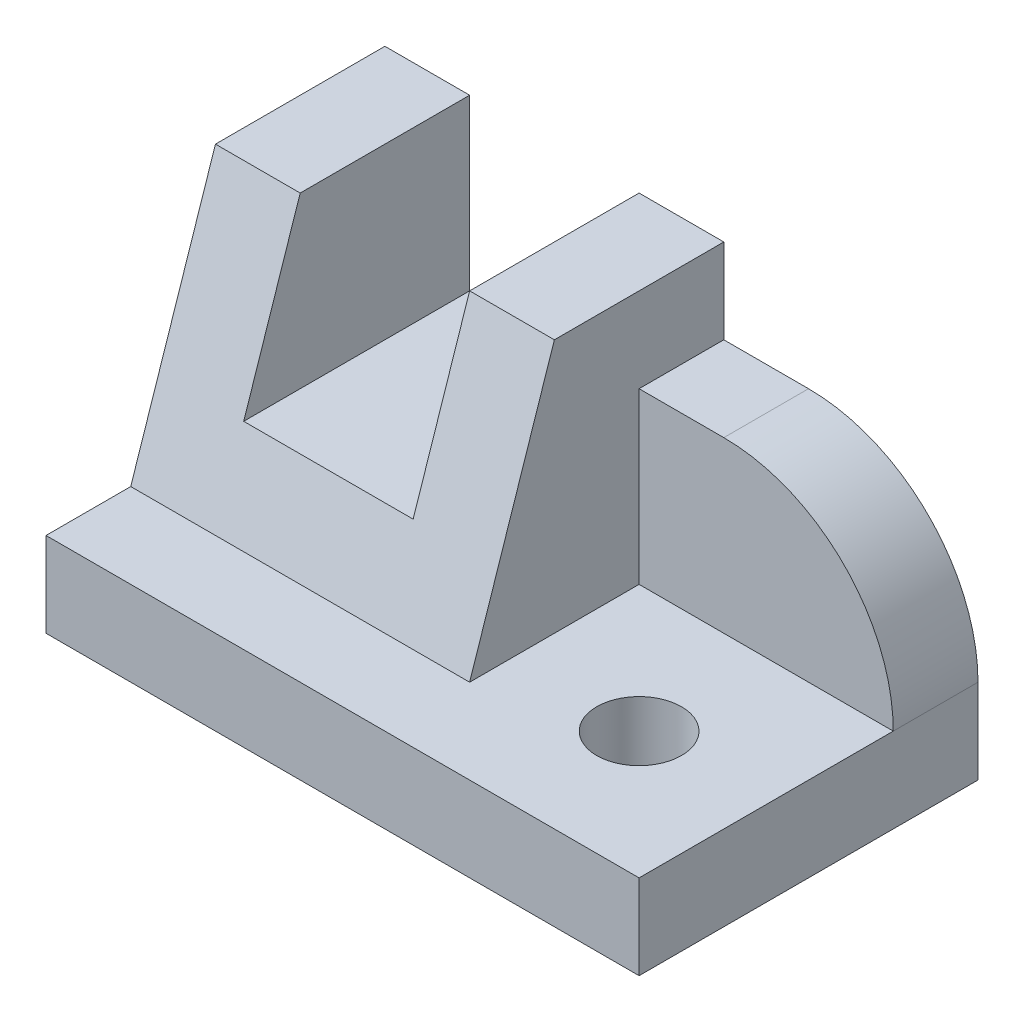
ISO-10303-21;
HEADER;
FILE_DESCRIPTION(('STEP AP214'),'2;1');
FILE_NAME('part.step','',(''),(''),'','','');
FILE_SCHEMA(('AUTOMOTIVE_DESIGN { 1 0 10303 214 1 1 1 1 }'));
ENDSEC;
DATA;
#1=APPLICATION_CONTEXT('core data for automotive mechanical design processes');
#2=APPLICATION_PROTOCOL_DEFINITION('international standard','automotive_design',2000,#1);
#3=PRODUCT_CONTEXT('',#1,'mechanical');
#4=PRODUCT('Part','Part','',(#3));
#5=PRODUCT_RELATED_PRODUCT_CATEGORY('part','',(#4));
#6=PRODUCT_DEFINITION_FORMATION('','',#4);
#7=PRODUCT_DEFINITION_CONTEXT('part definition',#1,'design');
#8=PRODUCT_DEFINITION('design','',#6,#7);
#9=PRODUCT_DEFINITION_SHAPE('','',#8);
#10=(LENGTH_UNIT() NAMED_UNIT(*) SI_UNIT(.MILLI.,.METRE.));
#11=(NAMED_UNIT(*) PLANE_ANGLE_UNIT() SI_UNIT($,.RADIAN.));
#12=(NAMED_UNIT(*) SI_UNIT($,.STERADIAN.) SOLID_ANGLE_UNIT());
#13=UNCERTAINTY_MEASURE_WITH_UNIT(LENGTH_MEASURE(1.E-05),#10,'distance_accuracy_value','');
#14=(GEOMETRIC_REPRESENTATION_CONTEXT(3) GLOBAL_UNCERTAINTY_ASSIGNED_CONTEXT((#13)) GLOBAL_UNIT_ASSIGNED_CONTEXT((#10,
#11,#12)) REPRESENTATION_CONTEXT('',''));
#15=CARTESIAN_POINT('',(0.,0.,0.));
#16=DIRECTION('',(0.,0.,1.));
#17=DIRECTION('',(1.,0.,0.));
#18=AXIS2_PLACEMENT_3D('',#15,#16,#17);
#19=CARTESIAN_POINT('',(40.,40.,-40.));
#20=DIRECTION('',(0.,-1.,0.));
#21=DIRECTION('',(0.,0.,-1.));
#22=AXIS2_PLACEMENT_3D('',#19,#20,#21);
#23=PLANE('',#22);
#24=DIRECTION('',(-1.,0.,0.));
#25=VECTOR('',#24,1.);
#26=CARTESIAN_POINT('',(40.,40.,-20.));
#27=LINE('',#26,#25);
#28=CARTESIAN_POINT('',(9.99999999999998,40.,-20.));
#29=VERTEX_POINT('',#28);
#30=CARTESIAN_POINT('',(0.,40.,-20.));
#31=VERTEX_POINT('',#30);
#32=EDGE_CURVE('E235',#29,#31,#27,.T.);
#33=ORIENTED_EDGE('',*,*,#32,.F.);
#34=DIRECTION('',(0.,0.,-1.));
#35=VECTOR('',#34,1.);
#36=CARTESIAN_POINT('',(9.99999999999998,40.,0.));
#37=LINE('',#36,#35);
#38=CARTESIAN_POINT('',(9.99999999999999,40.,-40.));
#39=VERTEX_POINT('',#38);
#40=EDGE_CURVE('E160',#29,#39,#37,.T.);
#41=ORIENTED_EDGE('',*,*,#40,.T.);
#42=DIRECTION('',(1.,0.,0.));
#43=VECTOR('',#42,1.);
#44=CARTESIAN_POINT('',(40.,40.,-40.));
#45=LINE('',#44,#43);
#46=CARTESIAN_POINT('',(0.,40.,-40.));
#47=VERTEX_POINT('',#46);
#48=EDGE_CURVE('E219',#47,#39,#45,.T.);
#49=ORIENTED_EDGE('',*,*,#48,.F.);
#50=DIRECTION('',(0.,0.,1.));
#51=VECTOR('',#50,1.);
#52=CARTESIAN_POINT('',(0.,40.,-40.));
#53=LINE('',#52,#51);
#54=EDGE_CURVE('E221',#47,#31,#53,.T.);
#55=ORIENTED_EDGE('',*,*,#54,.T.);
#56=EDGE_LOOP('',(#33,#41,#49,#55));
#57=FACE_BOUND('',#56,.T.);
#58=ADVANCED_FACE('F35',(#57),#23,.F.);
#59=CARTESIAN_POINT('',(40.,10.,-10.));
#60=DIRECTION('',(0.,0.316227766016838,0.948683298050514));
#61=DIRECTION('',(0.,-0.948683298050514,0.316227766016838));
#62=AXIS2_PLACEMENT_3D('',#59,#60,#61);
#63=PLANE('',#62);
#64=DIRECTION('',(0.,-0.948683298050514,0.316227766016838));
#65=VECTOR('',#64,1.);
#66=CARTESIAN_POINT('',(9.99999999999998,10.,-10.));
#67=LINE('',#66,#65);
#68=CARTESIAN_POINT('',(9.99999999999998,20.,-13.3333333333333));
#69=VERTEX_POINT('',#68);
#70=EDGE_CURVE('E168',#29,#69,#67,.T.);
#71=ORIENTED_EDGE('',*,*,#70,.F.);
#72=ORIENTED_EDGE('',*,*,#32,.T.);
#73=DIRECTION('',(0.,0.948683298050514,-0.316227766016838));
#74=VECTOR('',#73,1.);
#75=CARTESIAN_POINT('',(0.,10.,-10.));
#76=LINE('',#75,#74);
#77=CARTESIAN_POINT('',(0.,10.,-10.));
#78=VERTEX_POINT('',#77);
#79=EDGE_CURVE('E224',#78,#31,#76,.T.);
#80=ORIENTED_EDGE('',*,*,#79,.F.);
#81=DIRECTION('',(-1.,0.,0.));
#82=VECTOR('',#81,1.);
#83=CARTESIAN_POINT('',(40.,10.,-10.));
#84=LINE('',#83,#82);
#85=CARTESIAN_POINT('',(40.,10.,-10.));
#86=VERTEX_POINT('',#85);
#87=EDGE_CURVE('E228',#86,#78,#84,.T.);
#88=ORIENTED_EDGE('',*,*,#87,.F.);
#89=DIRECTION('',(0.,0.948683298050514,-0.316227766016838));
#90=VECTOR('',#89,1.);
#91=CARTESIAN_POINT('',(40.,10.,-10.));
#92=LINE('',#91,#90);
#93=CARTESIAN_POINT('',(40.,40.,-20.));
#94=VERTEX_POINT('',#93);
#95=EDGE_CURVE('E225',#86,#94,#92,.T.);
#96=ORIENTED_EDGE('',*,*,#95,.T.);
#97=CARTESIAN_POINT('',(30.,40.,-20.));
#98=VERTEX_POINT('',#97);
#99=EDGE_CURVE('E231',#94,#98,#27,.T.);
#100=ORIENTED_EDGE('',*,*,#99,.T.);
#101=DIRECTION('',(0.,0.948683298050514,-0.316227766016838));
#102=VECTOR('',#101,1.);
#103=CARTESIAN_POINT('',(30.,10.,-10.));
#104=LINE('',#103,#102);
#105=CARTESIAN_POINT('',(30.,20.,-13.3333333333333));
#106=VERTEX_POINT('',#105);
#107=EDGE_CURVE('E163',#106,#98,#104,.T.);
#108=ORIENTED_EDGE('',*,*,#107,.F.);
#109=DIRECTION('',(1.,0.,0.));
#110=VECTOR('',#109,1.);
#111=CARTESIAN_POINT('',(40.,20.,-13.3333333333333));
#112=LINE('',#111,#110);
#113=EDGE_CURVE('E140',#69,#106,#112,.T.);
#114=ORIENTED_EDGE('',*,*,#113,.F.);
#115=EDGE_LOOP('',(#71,#72,#80,#88,#96,#100,#108,#114));
#116=FACE_BOUND('',#115,.T.);
#117=ADVANCED_FACE('F270',(#116),#63,.T.);
#118=CARTESIAN_POINT('',(0.,0.,0.));
#119=DIRECTION('',(1.,0.,0.));
#120=DIRECTION('',(0.,0.,-1.));
#121=AXIS2_PLACEMENT_3D('',#118,#119,#120);
#122=PLANE('',#121);
#123=DIRECTION('',(0.,1.,0.));
#124=VECTOR('',#123,1.);
#125=CARTESIAN_POINT('',(0.,40.,-40.));
#126=LINE('',#125,#124);
#127=CARTESIAN_POINT('',(0.,0.,-40.));
#128=VERTEX_POINT('',#127);
#129=EDGE_CURVE('E216',#128,#47,#126,.T.);
#130=ORIENTED_EDGE('',*,*,#129,.F.);
#131=DIRECTION('',(0.,0.,-1.));
#132=VECTOR('',#131,1.);
#133=CARTESIAN_POINT('',(0.,0.,-40.));
#134=LINE('',#133,#132);
#135=CARTESIAN_POINT('',(0.,0.,0.));
#136=VERTEX_POINT('',#135);
#137=EDGE_CURVE('E174',#136,#128,#134,.T.);
#138=ORIENTED_EDGE('',*,*,#137,.F.);
#139=DIRECTION('',(0.,1.,0.));
#140=VECTOR('',#139,1.);
#141=CARTESIAN_POINT('',(0.,0.,0.));
#142=LINE('',#141,#140);
#143=CARTESIAN_POINT('',(0.,10.,0.));
#144=VERTEX_POINT('',#143);
#145=EDGE_CURVE('E192',#136,#144,#142,.T.);
#146=ORIENTED_EDGE('',*,*,#145,.T.);
#147=DIRECTION('',(0.,0.,-1.));
#148=VECTOR('',#147,1.);
#149=CARTESIAN_POINT('',(0.,10.,-40.));
#150=LINE('',#149,#148);
#151=EDGE_CURVE('E186',#144,#78,#150,.T.);
#152=ORIENTED_EDGE('',*,*,#151,.T.);
#153=ORIENTED_EDGE('',*,*,#79,.T.);
#154=ORIENTED_EDGE('',*,*,#54,.F.);
#155=EDGE_LOOP('',(#130,#138,#146,#152,#153,#154));
#156=FACE_BOUND('',#155,.T.);
#157=ADVANCED_FACE('F273',(#156),#122,.F.);
#158=CARTESIAN_POINT('',(30.,40.,-40.));
#159=VERTEX_POINT('',#158);
#160=CARTESIAN_POINT('',(40.,40.,-40.));
#161=VERTEX_POINT('',#160);
#162=EDGE_CURVE('E218',#159,#161,#45,.T.);
#163=ORIENTED_EDGE('',*,*,#162,.F.);
#164=DIRECTION('',(0.,0.,-1.));
#165=VECTOR('',#164,1.);
#166=CARTESIAN_POINT('',(30.,40.,0.));
#167=LINE('',#166,#165);
#168=EDGE_CURVE('E144',#98,#159,#167,.T.);
#169=ORIENTED_EDGE('',*,*,#168,.F.);
#170=ORIENTED_EDGE('',*,*,#99,.F.);
#171=DIRECTION('',(0.,0.,1.));
#172=VECTOR('',#171,1.);
#173=CARTESIAN_POINT('',(40.,40.,-40.));
#174=LINE('',#173,#172);
#175=EDGE_CURVE('E195',#161,#94,#174,.T.);
#176=ORIENTED_EDGE('',*,*,#175,.F.);
#177=EDGE_LOOP('',(#163,#169,#170,#176));
#178=FACE_BOUND('',#177,.T.);
#179=ADVANCED_FACE('F267',(#178),#23,.F.);
#180=CARTESIAN_POINT('',(0.,0.,-40.));
#181=DIRECTION('',(0.,0.,1.));
#182=DIRECTION('',(0.,-1.,0.));
#183=AXIS2_PLACEMENT_3D('',#180,#181,#182);
#184=PLANE('',#183);
#185=DIRECTION('',(1.,0.,0.));
#186=VECTOR('',#185,1.);
#187=CARTESIAN_POINT('',(40.,30.,-40.));
#188=LINE('',#187,#186);
#189=CARTESIAN_POINT('',(40.,30.,-40.));
#190=VERTEX_POINT('',#189);
#191=CARTESIAN_POINT('',(50.,30.,-40.));
#192=VERTEX_POINT('',#191);
#193=EDGE_CURVE('E209',#190,#192,#188,.T.);
#194=ORIENTED_EDGE('',*,*,#193,.T.);
#195=CARTESIAN_POINT('',(50.,9.99999999999999,-40.));
#196=DIRECTION('',(0.,0.,1.));
#197=DIRECTION('',(0.,-1.,0.));
#198=AXIS2_PLACEMENT_3D('',#195,#196,#197);
#199=CIRCLE('',#198,20.);
#200=CARTESIAN_POINT('',(70.,10.,-40.));
#201=VERTEX_POINT('',#200);
#202=EDGE_CURVE('E50',#192,#201,#199,.F.);
#203=ORIENTED_EDGE('',*,*,#202,.T.);
#204=DIRECTION('',(0.,1.,0.));
#205=VECTOR('',#204,1.);
#206=CARTESIAN_POINT('',(70.,40.,-40.));
#207=LINE('',#206,#205);
#208=CARTESIAN_POINT('',(70.,0.,-40.));
#209=VERTEX_POINT('',#208);
#210=EDGE_CURVE('E211',#209,#201,#207,.T.);
#211=ORIENTED_EDGE('',*,*,#210,.F.);
#212=DIRECTION('',(1.,0.,0.));
#213=VECTOR('',#212,1.);
#214=CARTESIAN_POINT('',(70.,0.,-40.));
#215=LINE('',#214,#213);
#216=EDGE_CURVE('E178',#128,#209,#215,.T.);
#217=ORIENTED_EDGE('',*,*,#216,.F.);
#218=ORIENTED_EDGE('',*,*,#129,.T.);
#219=ORIENTED_EDGE('',*,*,#48,.T.);
#220=DIRECTION('',(0.,1.,0.));
#221=VECTOR('',#220,1.);
#222=CARTESIAN_POINT('',(9.99999999999999,20.,-40.));
#223=LINE('',#222,#221);
#224=CARTESIAN_POINT('',(9.99999999999999,20.,-40.));
#225=VERTEX_POINT('',#224);
#226=EDGE_CURVE('E155',#225,#39,#223,.T.);
#227=ORIENTED_EDGE('',*,*,#226,.F.);
#228=DIRECTION('',(-1.,0.,0.));
#229=VECTOR('',#228,1.);
#230=CARTESIAN_POINT('',(30.,20.,-40.));
#231=LINE('',#230,#229);
#232=CARTESIAN_POINT('',(30.,20.,-40.));
#233=VERTEX_POINT('',#232);
#234=EDGE_CURVE('E137',#233,#225,#231,.T.);
#235=ORIENTED_EDGE('',*,*,#234,.F.);
#236=DIRECTION('',(0.,-1.,0.));
#237=VECTOR('',#236,1.);
#238=CARTESIAN_POINT('',(30.,40.,-40.));
#239=LINE('',#238,#237);
#240=EDGE_CURVE('E147',#159,#233,#239,.T.);
#241=ORIENTED_EDGE('',*,*,#240,.F.);
#242=ORIENTED_EDGE('',*,*,#162,.T.);
#243=DIRECTION('',(0.,1.,0.));
#244=VECTOR('',#243,1.);
#245=CARTESIAN_POINT('',(40.,30.,-40.));
#246=LINE('',#245,#244);
#247=EDGE_CURVE('E205',#190,#161,#246,.T.);
#248=ORIENTED_EDGE('',*,*,#247,.F.);
#249=EDGE_LOOP('',(#194,#203,#211,#217,#218,#219,#227,#235,#241,#242,#248));
#250=FACE_BOUND('',#249,.T.);
#251=ADVANCED_FACE('F153',(#250),#184,.F.);
#252=CARTESIAN_POINT('',(70.,0.,0.));
#253=DIRECTION('',(-1.,0.,0.));
#254=DIRECTION('',(0.,0.,1.));
#255=AXIS2_PLACEMENT_3D('',#252,#253,#254);
#256=PLANE('',#255);
#257=ORIENTED_EDGE('',*,*,#210,.T.);
#258=DIRECTION('',(0.,0.,-1.));
#259=VECTOR('',#258,1.);
#260=CARTESIAN_POINT('',(70.,9.99999999999999,0.));
#261=LINE('',#260,#259);
#262=CARTESIAN_POINT('',(70.,10.,-30.));
#263=VERTEX_POINT('',#262);
#264=EDGE_CURVE('E43',#201,#263,#261,.F.);
#265=ORIENTED_EDGE('',*,*,#264,.T.);
#266=DIRECTION('',(0.,0.,1.));
#267=VECTOR('',#266,1.);
#268=CARTESIAN_POINT('',(70.,10.,0.));
#269=LINE('',#268,#267);
#270=CARTESIAN_POINT('',(70.,10.,0.));
#271=VERTEX_POINT('',#270);
#272=EDGE_CURVE('E175',#263,#271,#269,.T.);
#273=ORIENTED_EDGE('',*,*,#272,.T.);
#274=DIRECTION('',(0.,1.,0.));
#275=VECTOR('',#274,1.);
#276=CARTESIAN_POINT('',(70.,0.,0.));
#277=LINE('',#276,#275);
#278=CARTESIAN_POINT('',(70.,0.,0.));
#279=VERTEX_POINT('',#278);
#280=EDGE_CURVE('E183',#279,#271,#277,.T.);
#281=ORIENTED_EDGE('',*,*,#280,.F.);
#282=DIRECTION('',(0.,0.,1.));
#283=VECTOR('',#282,1.);
#284=CARTESIAN_POINT('',(70.,0.,0.));
#285=LINE('',#284,#283);
#286=EDGE_CURVE('E181',#209,#279,#285,.T.);
#287=ORIENTED_EDGE('',*,*,#286,.F.);
#288=EDGE_LOOP('',(#257,#265,#273,#281,#287));
#289=FACE_BOUND('',#288,.T.);
#290=ADVANCED_FACE('F245',(#289),#256,.F.);
#291=CARTESIAN_POINT('',(40.,30.,-30.));
#292=DIRECTION('',(0.,-1.,0.));
#293=DIRECTION('',(0.,0.,-1.));
#294=AXIS2_PLACEMENT_3D('',#291,#292,#293);
#295=PLANE('',#294);
#296=DIRECTION('',(1.,0.,0.));
#297=VECTOR('',#296,1.);
#298=CARTESIAN_POINT('',(40.,30.,-30.));
#299=LINE('',#298,#297);
#300=CARTESIAN_POINT('',(40.,30.,-30.));
#301=VERTEX_POINT('',#300);
#302=CARTESIAN_POINT('',(50.,30.,-30.));
#303=VERTEX_POINT('',#302);
#304=EDGE_CURVE('E212',#301,#303,#299,.T.);
#305=ORIENTED_EDGE('',*,*,#304,.T.);
#306=DIRECTION('',(0.,0.,-1.));
#307=VECTOR('',#306,1.);
#308=CARTESIAN_POINT('',(50.,30.,-30.));
#309=LINE('',#308,#307);
#310=EDGE_CURVE('E234',#303,#192,#309,.T.);
#311=ORIENTED_EDGE('',*,*,#310,.T.);
#312=ORIENTED_EDGE('',*,*,#193,.F.);
#313=DIRECTION('',(0.,0.,-1.));
#314=VECTOR('',#313,1.);
#315=CARTESIAN_POINT('',(40.,30.,-30.));
#316=LINE('',#315,#314);
#317=EDGE_CURVE('E202',#301,#190,#316,.T.);
#318=ORIENTED_EDGE('',*,*,#317,.F.);
#319=EDGE_LOOP('',(#305,#311,#312,#318));
#320=FACE_BOUND('',#319,.T.);
#321=ADVANCED_FACE('F259',(#320),#295,.F.);
#322=CARTESIAN_POINT('',(40.,10.,-30.));
#323=DIRECTION('',(0.,0.,-1.));
#324=DIRECTION('',(-1.,0.,0.));
#325=AXIS2_PLACEMENT_3D('',#322,#323,#324);
#326=PLANE('',#325);
#327=DIRECTION('',(1.,0.,0.));
#328=VECTOR('',#327,1.);
#329=CARTESIAN_POINT('',(40.,10.,-30.));
#330=LINE('',#329,#328);
#331=CARTESIAN_POINT('',(40.,10.,-30.));
#332=VERTEX_POINT('',#331);
#333=EDGE_CURVE('E208',#332,#263,#330,.T.);
#334=ORIENTED_EDGE('',*,*,#333,.T.);
#335=CARTESIAN_POINT('',(50.,9.99999999999999,-30.));
#336=DIRECTION('',(0.,0.,-1.));
#337=DIRECTION('',(-1.,0.,0.));
#338=AXIS2_PLACEMENT_3D('',#335,#336,#337);
#339=CIRCLE('',#338,20.);
#340=EDGE_CURVE('E11',#263,#303,#339,.F.);
#341=ORIENTED_EDGE('',*,*,#340,.T.);
#342=ORIENTED_EDGE('',*,*,#304,.F.);
#343=DIRECTION('',(0.,1.,0.));
#344=VECTOR('',#343,1.);
#345=CARTESIAN_POINT('',(40.,10.,-30.));
#346=LINE('',#345,#344);
#347=EDGE_CURVE('E199',#332,#301,#346,.T.);
#348=ORIENTED_EDGE('',*,*,#347,.F.);
#349=EDGE_LOOP('',(#334,#341,#342,#348));
#350=FACE_BOUND('',#349,.T.);
#351=ADVANCED_FACE('F252',(#350),#326,.F.);
#352=CARTESIAN_POINT('',(40.,0.,0.));
#353=DIRECTION('',(-1.,0.,0.));
#354=DIRECTION('',(0.,0.,1.));
#355=AXIS2_PLACEMENT_3D('',#352,#353,#354);
#356=PLANE('',#355);
#357=ORIENTED_EDGE('',*,*,#95,.F.);
#358=DIRECTION('',(0.,0.,-1.));
#359=VECTOR('',#358,1.);
#360=CARTESIAN_POINT('',(40.,10.,0.));
#361=LINE('',#360,#359);
#362=EDGE_CURVE('E197',#86,#332,#361,.T.);
#363=ORIENTED_EDGE('',*,*,#362,.T.);
#364=ORIENTED_EDGE('',*,*,#347,.T.);
#365=ORIENTED_EDGE('',*,*,#317,.T.);
#366=ORIENTED_EDGE('',*,*,#247,.T.);
#367=ORIENTED_EDGE('',*,*,#175,.T.);
#368=EDGE_LOOP('',(#357,#363,#364,#365,#366,#367));
#369=FACE_BOUND('',#368,.T.);
#370=ADVANCED_FACE('F264',(#369),#356,.F.);
#371=CARTESIAN_POINT('',(0.,10.,0.));
#372=DIRECTION('',(0.,1.,0.));
#373=DIRECTION('',(0.,0.,1.));
#374=AXIS2_PLACEMENT_3D('',#371,#372,#373);
#375=PLANE('',#374);
#376=CARTESIAN_POINT('',(55.,10.,-15.));
#377=DIRECTION('',(0.,1.,0.));
#378=DIRECTION('',(0.,0.,1.));
#379=AXIS2_PLACEMENT_3D('',#376,#377,#378);
#380=CIRCLE('',#379,4.99999999999998);
#381=CARTESIAN_POINT('',(55.,10.,-10.));
#382=VERTEX_POINT('',#381);
#383=EDGE_CURVE('E151',#382,#382,#380,.T.);
#384=ORIENTED_EDGE('',*,*,#383,.F.);
#385=EDGE_LOOP('',(#384));
#386=FACE_BOUND('',#385,.T.);
#387=ORIENTED_EDGE('',*,*,#333,.F.);
#388=ORIENTED_EDGE('',*,*,#362,.F.);
#389=ORIENTED_EDGE('',*,*,#87,.T.);
#390=ORIENTED_EDGE('',*,*,#151,.F.);
#391=DIRECTION('',(-1.,0.,0.));
#392=VECTOR('',#391,1.);
#393=CARTESIAN_POINT('',(0.,10.,0.));
#394=LINE('',#393,#392);
#395=EDGE_CURVE('E170',#271,#144,#394,.T.);
#396=ORIENTED_EDGE('',*,*,#395,.F.);
#397=ORIENTED_EDGE('',*,*,#272,.F.);
#398=EDGE_LOOP('',(#387,#388,#389,#390,#396,#397));
#399=FACE_BOUND('',#398,.T.);
#400=ADVANCED_FACE('F256',(#386,#399),#375,.T.);
#401=CARTESIAN_POINT('',(0.,0.,0.));
#402=DIRECTION('',(0.,0.,-1.));
#403=DIRECTION('',(-1.,0.,0.));
#404=AXIS2_PLACEMENT_3D('',#401,#402,#403);
#405=PLANE('',#404);
#406=ORIENTED_EDGE('',*,*,#395,.T.);
#407=ORIENTED_EDGE('',*,*,#145,.F.);
#408=DIRECTION('',(-1.,0.,0.));
#409=VECTOR('',#408,1.);
#410=CARTESIAN_POINT('',(0.,0.,0.));
#411=LINE('',#410,#409);
#412=EDGE_CURVE('E171',#279,#136,#411,.T.);
#413=ORIENTED_EDGE('',*,*,#412,.F.);
#414=ORIENTED_EDGE('',*,*,#280,.T.);
#415=EDGE_LOOP('',(#406,#407,#413,#414));
#416=FACE_BOUND('',#415,.T.);
#417=ADVANCED_FACE('F278',(#416),#405,.F.);
#418=CARTESIAN_POINT('',(0.,0.,0.));
#419=DIRECTION('',(0.,1.,0.));
#420=DIRECTION('',(0.,0.,1.));
#421=AXIS2_PLACEMENT_3D('',#418,#419,#420);
#422=PLANE('',#421);
#423=CARTESIAN_POINT('',(55.,0.,-15.));
#424=DIRECTION('',(0.,-1.,0.));
#425=DIRECTION('',(0.,0.,-1.));
#426=AXIS2_PLACEMENT_3D('',#423,#424,#425);
#427=CIRCLE('',#426,4.99999999999998);
#428=CARTESIAN_POINT('',(55.,0.,-20.));
#429=VERTEX_POINT('',#428);
#430=EDGE_CURVE('E240',#429,#429,#427,.T.);
#431=ORIENTED_EDGE('',*,*,#430,.F.);
#432=EDGE_LOOP('',(#431));
#433=FACE_BOUND('',#432,.T.);
#434=ORIENTED_EDGE('',*,*,#412,.T.);
#435=ORIENTED_EDGE('',*,*,#137,.T.);
#436=ORIENTED_EDGE('',*,*,#216,.T.);
#437=ORIENTED_EDGE('',*,*,#286,.T.);
#438=EDGE_LOOP('',(#434,#435,#436,#437));
#439=FACE_BOUND('',#438,.T.);
#440=ADVANCED_FACE('F280',(#433,#439),#422,.F.);
#441=CARTESIAN_POINT('',(9.99999999999998,20.,0.));
#442=DIRECTION('',(-1.,0.,0.));
#443=DIRECTION('',(0.,0.,1.));
#444=AXIS2_PLACEMENT_3D('',#441,#442,#443);
#445=PLANE('',#444);
#446=ORIENTED_EDGE('',*,*,#70,.T.);
#447=DIRECTION('',(0.,0.,-1.));
#448=VECTOR('',#447,1.);
#449=CARTESIAN_POINT('',(9.99999999999998,20.,0.));
#450=LINE('',#449,#448);
#451=EDGE_CURVE('E143',#69,#225,#450,.T.);
#452=ORIENTED_EDGE('',*,*,#451,.T.);
#453=ORIENTED_EDGE('',*,*,#226,.T.);
#454=ORIENTED_EDGE('',*,*,#40,.F.);
#455=EDGE_LOOP('',(#446,#452,#453,#454));
#456=FACE_BOUND('',#455,.T.);
#457=ADVANCED_FACE('F286',(#456),#445,.F.);
#458=CARTESIAN_POINT('',(30.,20.,0.));
#459=DIRECTION('',(0.,-1.,0.));
#460=DIRECTION('',(0.,0.,-1.));
#461=AXIS2_PLACEMENT_3D('',#458,#459,#460);
#462=PLANE('',#461);
#463=ORIENTED_EDGE('',*,*,#113,.T.);
#464=DIRECTION('',(0.,0.,-1.));
#465=VECTOR('',#464,1.);
#466=CARTESIAN_POINT('',(30.,20.,0.));
#467=LINE('',#466,#465);
#468=EDGE_CURVE('E132',#106,#233,#467,.T.);
#469=ORIENTED_EDGE('',*,*,#468,.T.);
#470=ORIENTED_EDGE('',*,*,#234,.T.);
#471=ORIENTED_EDGE('',*,*,#451,.F.);
#472=EDGE_LOOP('',(#463,#469,#470,#471));
#473=FACE_BOUND('',#472,.T.);
#474=ADVANCED_FACE('F134',(#473),#462,.F.);
#475=CARTESIAN_POINT('',(30.,40.,0.));
#476=DIRECTION('',(1.,0.,0.));
#477=DIRECTION('',(0.,0.,-1.));
#478=AXIS2_PLACEMENT_3D('',#475,#476,#477);
#479=PLANE('',#478);
#480=ORIENTED_EDGE('',*,*,#107,.T.);
#481=ORIENTED_EDGE('',*,*,#168,.T.);
#482=ORIENTED_EDGE('',*,*,#240,.T.);
#483=ORIENTED_EDGE('',*,*,#468,.F.);
#484=EDGE_LOOP('',(#480,#481,#482,#483));
#485=FACE_BOUND('',#484,.T.);
#486=ADVANCED_FACE('F148',(#485),#479,.F.);
#487=CARTESIAN_POINT('',(55.,0.,-15.));
#488=DIRECTION('',(0.,-1.,0.));
#489=DIRECTION('',(0.,0.,-1.));
#490=AXIS2_PLACEMENT_3D('',#487,#488,#489);
#491=CYLINDRICAL_SURFACE('',#490,4.99999999999998);
#492=ORIENTED_EDGE('',*,*,#383,.T.);
#493=EDGE_LOOP('',(#492));
#494=FACE_BOUND('',#493,.T.);
#495=ORIENTED_EDGE('',*,*,#430,.T.);
#496=EDGE_LOOP('',(#495));
#497=FACE_BOUND('',#496,.T.);
#498=ADVANCED_FACE('F346',(#494,#497),#491,.F.);
#499=CARTESIAN_POINT('',(50.,9.99999999999999,-30.));
#500=DIRECTION('',(0.,0.,-1.));
#501=DIRECTION('',(-1.,0.,0.));
#502=AXIS2_PLACEMENT_3D('',#499,#500,#501);
#503=CYLINDRICAL_SURFACE('',#502,20.);
#504=ORIENTED_EDGE('',*,*,#340,.F.);
#505=ORIENTED_EDGE('',*,*,#264,.F.);
#506=ORIENTED_EDGE('',*,*,#202,.F.);
#507=ORIENTED_EDGE('',*,*,#310,.F.);
#508=EDGE_LOOP('',(#504,#505,#506,#507));
#509=FACE_BOUND('',#508,.T.);
#510=ADVANCED_FACE('F37',(#509),#503,.T.);
#511=CLOSED_SHELL('',(#58,#117,#157,#179,#251,#290,#321,#351,#370,#400,#417,#440,#457,#474,#486,
#498,#510));
#512=MANIFOLD_SOLID_BREP('B2',#511);
#513=ADVANCED_BREP_SHAPE_REPRESENTATION('',(#18,#512),#14);
#514=SHAPE_DEFINITION_REPRESENTATION(#9,#513);
ENDSEC;
END-ISO-10303-21;
